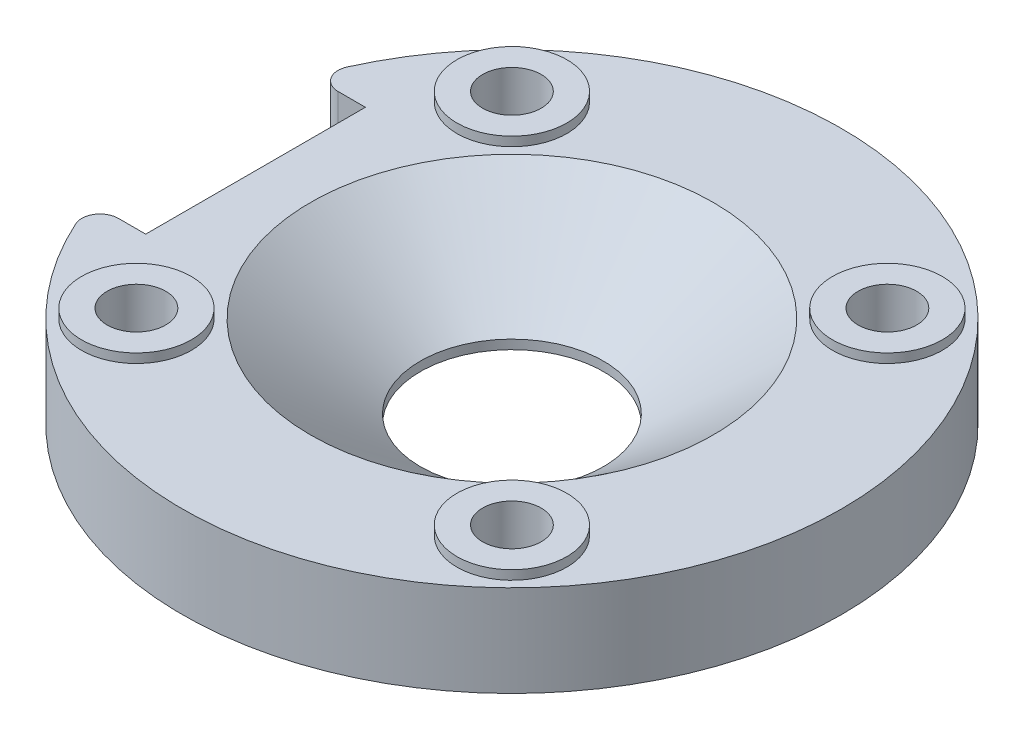
ISO-10303-21;
HEADER;
FILE_DESCRIPTION(('STEP AP214'),'2;1');
FILE_NAME('part.step','',(''),(''),'','','');
FILE_SCHEMA(('AUTOMOTIVE_DESIGN { 1 0 10303 214 1 1 1 1 }'));
ENDSEC;
DATA;
#1=APPLICATION_CONTEXT('core data for automotive mechanical design processes');
#2=APPLICATION_PROTOCOL_DEFINITION('international standard','automotive_design',2000,#1);
#3=PRODUCT_CONTEXT('',#1,'mechanical');
#4=PRODUCT('Part','Part','',(#3));
#5=PRODUCT_RELATED_PRODUCT_CATEGORY('part','',(#4));
#6=PRODUCT_DEFINITION_FORMATION('','',#4);
#7=PRODUCT_DEFINITION_CONTEXT('part definition',#1,'design');
#8=PRODUCT_DEFINITION('design','',#6,#7);
#9=PRODUCT_DEFINITION_SHAPE('','',#8);
#10=(LENGTH_UNIT() NAMED_UNIT(*) SI_UNIT(.MILLI.,.METRE.));
#11=(NAMED_UNIT(*) PLANE_ANGLE_UNIT() SI_UNIT($,.RADIAN.));
#12=(NAMED_UNIT(*) SI_UNIT($,.STERADIAN.) SOLID_ANGLE_UNIT());
#13=UNCERTAINTY_MEASURE_WITH_UNIT(LENGTH_MEASURE(1.E-05),#10,'distance_accuracy_value','');
#14=(GEOMETRIC_REPRESENTATION_CONTEXT(3) GLOBAL_UNCERTAINTY_ASSIGNED_CONTEXT((#13)) GLOBAL_UNIT_ASSIGNED_CONTEXT((#10,
#11,#12)) REPRESENTATION_CONTEXT('',''));
#15=CARTESIAN_POINT('',(0.,0.,0.));
#16=DIRECTION('',(0.,0.,1.));
#17=DIRECTION('',(1.,0.,0.));
#18=AXIS2_PLACEMENT_3D('',#15,#16,#17);
#19=CARTESIAN_POINT('',(0.,5.,0.));
#20=DIRECTION('',(0.,1.,0.));
#21=DIRECTION('',(0.,0.,1.));
#22=AXIS2_PLACEMENT_3D('',#19,#20,#21);
#23=PLANE('',#22);
#24=CARTESIAN_POINT('',(10.2530483272049,5.,10.253048327205));
#25=DIRECTION('',(0.,1.,0.));
#26=DIRECTION('',(0.,0.,1.));
#27=AXIS2_PLACEMENT_3D('',#24,#25,#26);
#28=CIRCLE('',#27,3.);
#29=CARTESIAN_POINT('',(10.2530483272049,5.,13.253048327205));
#30=VERTEX_POINT('',#29);
#31=EDGE_CURVE('E135',#30,#30,#28,.T.);
#32=ORIENTED_EDGE('',*,*,#31,.F.);
#33=EDGE_LOOP('',(#32));
#34=FACE_BOUND('',#33,.T.);
#35=CARTESIAN_POINT('',(-10.2530483272049,5.,-10.253048327205));
#36=DIRECTION('',(0.,1.,0.));
#37=DIRECTION('',(0.,0.,1.));
#38=AXIS2_PLACEMENT_3D('',#35,#36,#37);
#39=CIRCLE('',#38,3.);
#40=CARTESIAN_POINT('',(-10.2530483272049,5.,-7.25304832720495));
#41=VERTEX_POINT('',#40);
#42=EDGE_CURVE('E153',#41,#41,#39,.T.);
#43=ORIENTED_EDGE('',*,*,#42,.F.);
#44=EDGE_LOOP('',(#43));
#45=FACE_BOUND('',#44,.T.);
#46=CARTESIAN_POINT('',(0.,5.,0.));
#47=DIRECTION('',(0.,1.,0.));
#48=DIRECTION('',(0.,0.,1.));
#49=AXIS2_PLACEMENT_3D('',#46,#47,#48);
#50=CIRCLE('',#49,11.);
#51=CARTESIAN_POINT('',(0.,5.,11.));
#52=VERTEX_POINT('',#51);
#53=EDGE_CURVE('E172',#52,#52,#50,.F.);
#54=ORIENTED_EDGE('',*,*,#53,.T.);
#55=EDGE_LOOP('',(#54));
#56=FACE_BOUND('',#55,.T.);
#57=CARTESIAN_POINT('',(10.2530483272049,5.,-10.253048327205));
#58=DIRECTION('',(0.,1.,0.));
#59=DIRECTION('',(0.,0.,-1.));
#60=AXIS2_PLACEMENT_3D('',#57,#58,#59);
#61=CIRCLE('',#60,3.);
#62=CARTESIAN_POINT('',(10.2530483272049,5.,-13.253048327205));
#63=VERTEX_POINT('',#62);
#64=EDGE_CURVE('E144',#63,#63,#61,.T.);
#65=ORIENTED_EDGE('',*,*,#64,.F.);
#66=EDGE_LOOP('',(#65));
#67=FACE_BOUND('',#66,.T.);
#68=CARTESIAN_POINT('',(-10.2530483272049,5.,10.253048327205));
#69=DIRECTION('',(0.,1.,0.));
#70=DIRECTION('',(0.,0.,-1.));
#71=AXIS2_PLACEMENT_3D('',#68,#69,#70);
#72=CIRCLE('',#71,3.);
#73=CARTESIAN_POINT('',(-10.2530483272049,5.,7.25304832720497));
#74=VERTEX_POINT('',#73);
#75=EDGE_CURVE('E122',#74,#74,#72,.T.);
#76=ORIENTED_EDGE('',*,*,#75,.F.);
#77=EDGE_LOOP('',(#76));
#78=FACE_BOUND('',#77,.T.);
#79=DIRECTION('',(-1.,0.,0.));
#80=VECTOR('',#79,1.);
#81=CARTESIAN_POINT('',(0.,5.,6.));
#82=LINE('',#81,#80);
#83=CARTESIAN_POINT('',(-14.,5.,6.));
#84=VERTEX_POINT('',#83);
#85=CARTESIAN_POINT('',(-15.4919333848297,5.,6.));
#86=VERTEX_POINT('',#85);
#87=EDGE_CURVE('E94',#84,#86,#82,.T.);
#88=ORIENTED_EDGE('',*,*,#87,.T.);
#89=CARTESIAN_POINT('',(-15.4919333848297,5.,7.));
#90=DIRECTION('',(0.,1.,0.));
#91=DIRECTION('',(0.,0.,1.));
#92=AXIS2_PLACEMENT_3D('',#89,#90,#91);
#93=CIRCLE('',#92,1.);
#94=CARTESIAN_POINT('',(-16.4032235839373,5.,7.41176470588235));
#95=VERTEX_POINT('',#94);
#96=EDGE_CURVE('E189',#86,#95,#93,.T.);
#97=ORIENTED_EDGE('',*,*,#96,.T.);
#98=CARTESIAN_POINT('',(0.,5.,0.));
#99=DIRECTION('',(0.,1.,0.));
#100=DIRECTION('',(0.,0.,1.));
#101=AXIS2_PLACEMENT_3D('',#98,#99,#100);
#102=CIRCLE('',#101,18.);
#103=CARTESIAN_POINT('',(-16.4032235839373,5.,-7.41176470588235));
#104=VERTEX_POINT('',#103);
#105=EDGE_CURVE('E165',#95,#104,#102,.T.);
#106=ORIENTED_EDGE('',*,*,#105,.T.);
#107=CARTESIAN_POINT('',(-15.4919333848297,5.,-7.));
#108=DIRECTION('',(0.,1.,0.));
#109=DIRECTION('',(0.,0.,1.));
#110=AXIS2_PLACEMENT_3D('',#107,#108,#109);
#111=CIRCLE('',#110,1.);
#112=CARTESIAN_POINT('',(-15.4919333848297,5.,-6.));
#113=VERTEX_POINT('',#112);
#114=EDGE_CURVE('E187',#104,#113,#111,.T.);
#115=ORIENTED_EDGE('',*,*,#114,.T.);
#116=DIRECTION('',(1.,0.,0.));
#117=VECTOR('',#116,1.);
#118=CARTESIAN_POINT('',(0.,5.,-6.));
#119=LINE('',#118,#117);
#120=CARTESIAN_POINT('',(-14.,5.,-6.));
#121=VERTEX_POINT('',#120);
#122=EDGE_CURVE('E118',#113,#121,#119,.T.);
#123=ORIENTED_EDGE('',*,*,#122,.T.);
#124=DIRECTION('',(0.,0.,1.));
#125=VECTOR('',#124,1.);
#126=CARTESIAN_POINT('',(-14.,5.,0.));
#127=LINE('',#126,#125);
#128=EDGE_CURVE('E111',#121,#84,#127,.T.);
#129=ORIENTED_EDGE('',*,*,#128,.T.);
#130=EDGE_LOOP('',(#88,#97,#106,#115,#123,#129));
#131=FACE_BOUND('',#130,.T.);
#132=ADVANCED_FACE('F40',(#34,#45,#56,#67,#78,#131),#23,.T.);
#133=CARTESIAN_POINT('',(0.,0.,0.));
#134=DIRECTION('',(0.,1.,0.));
#135=DIRECTION('',(0.,0.,1.));
#136=AXIS2_PLACEMENT_3D('',#133,#134,#135);
#137=PLANE('',#136);
#138=CARTESIAN_POINT('',(0.,0.,0.));
#139=DIRECTION('',(0.,1.,0.));
#140=DIRECTION('',(0.,0.,1.));
#141=AXIS2_PLACEMENT_3D('',#138,#139,#140);
#142=CIRCLE('',#141,5.);
#143=CARTESIAN_POINT('',(0.,0.,5.));
#144=VERTEX_POINT('',#143);
#145=EDGE_CURVE('E160',#144,#144,#142,.T.);
#146=ORIENTED_EDGE('',*,*,#145,.T.);
#147=EDGE_LOOP('',(#146));
#148=FACE_BOUND('',#147,.T.);
#149=CARTESIAN_POINT('',(-10.2530483272049,0.,-10.253048327205));
#150=DIRECTION('',(0.,1.,0.));
#151=DIRECTION('',(0.,0.,1.));
#152=AXIS2_PLACEMENT_3D('',#149,#150,#151);
#153=CIRCLE('',#152,1.6);
#154=CARTESIAN_POINT('',(-10.2530483272049,0.,-8.65304832720495));
#155=VERTEX_POINT('',#154);
#156=EDGE_CURVE('E157',#155,#155,#153,.F.);
#157=ORIENTED_EDGE('',*,*,#156,.F.);
#158=EDGE_LOOP('',(#157));
#159=FACE_BOUND('',#158,.T.);
#160=CARTESIAN_POINT('',(-10.2530483272049,0.,10.253048327205));
#161=DIRECTION('',(0.,1.,0.));
#162=DIRECTION('',(0.,0.,1.));
#163=AXIS2_PLACEMENT_3D('',#160,#161,#162);
#164=CIRCLE('',#163,1.6);
#165=CARTESIAN_POINT('',(-10.2530483272049,0.,11.853048327205));
#166=VERTEX_POINT('',#165);
#167=EDGE_CURVE('E177',#166,#166,#164,.F.);
#168=ORIENTED_EDGE('',*,*,#167,.F.);
#169=EDGE_LOOP('',(#168));
#170=FACE_BOUND('',#169,.T.);
#171=CARTESIAN_POINT('',(10.2530483272049,0.,10.253048327205));
#172=DIRECTION('',(0.,1.,0.));
#173=DIRECTION('',(0.,0.,1.));
#174=AXIS2_PLACEMENT_3D('',#171,#172,#173);
#175=CIRCLE('',#174,1.6);
#176=CARTESIAN_POINT('',(10.2530483272049,0.,11.853048327205));
#177=VERTEX_POINT('',#176);
#178=EDGE_CURVE('E180',#177,#177,#175,.F.);
#179=ORIENTED_EDGE('',*,*,#178,.F.);
#180=EDGE_LOOP('',(#179));
#181=FACE_BOUND('',#180,.T.);
#182=CARTESIAN_POINT('',(10.2530483272049,0.,-10.253048327205));
#183=DIRECTION('',(0.,1.,0.));
#184=DIRECTION('',(0.,0.,1.));
#185=AXIS2_PLACEMENT_3D('',#182,#183,#184);
#186=CIRCLE('',#185,1.6);
#187=CARTESIAN_POINT('',(10.2530483272049,0.,-8.65304832720495));
#188=VERTEX_POINT('',#187);
#189=EDGE_CURVE('E164',#188,#188,#186,.F.);
#190=ORIENTED_EDGE('',*,*,#189,.F.);
#191=EDGE_LOOP('',(#190));
#192=FACE_BOUND('',#191,.T.);
#193=CARTESIAN_POINT('',(0.,0.,0.));
#194=DIRECTION('',(0.,1.,0.));
#195=DIRECTION('',(0.,0.,1.));
#196=AXIS2_PLACEMENT_3D('',#193,#194,#195);
#197=CIRCLE('',#196,18.);
#198=CARTESIAN_POINT('',(-16.4032235839373,0.,7.41176470588235));
#199=VERTEX_POINT('',#198);
#200=CARTESIAN_POINT('',(-16.4032235839373,0.,-7.41176470588235));
#201=VERTEX_POINT('',#200);
#202=EDGE_CURVE('E163',#199,#201,#197,.T.);
#203=ORIENTED_EDGE('',*,*,#202,.F.);
#204=CARTESIAN_POINT('',(-15.4919333848297,0.,7.));
#205=DIRECTION('',(0.,1.,0.));
#206=DIRECTION('',(0.,0.,1.));
#207=AXIS2_PLACEMENT_3D('',#204,#205,#206);
#208=CIRCLE('',#207,1.);
#209=CARTESIAN_POINT('',(-15.4919333848297,0.,6.));
#210=VERTEX_POINT('',#209);
#211=EDGE_CURVE('E48',#199,#210,#208,.F.);
#212=ORIENTED_EDGE('',*,*,#211,.T.);
#213=DIRECTION('',(-1.,0.,0.));
#214=VECTOR('',#213,1.);
#215=CARTESIAN_POINT('',(0.,0.,6.));
#216=LINE('',#215,#214);
#217=CARTESIAN_POINT('',(-14.,0.,6.));
#218=VERTEX_POINT('',#217);
#219=EDGE_CURVE('E105',#218,#210,#216,.T.);
#220=ORIENTED_EDGE('',*,*,#219,.F.);
#221=DIRECTION('',(0.,0.,1.));
#222=VECTOR('',#221,1.);
#223=CARTESIAN_POINT('',(-14.,0.,0.));
#224=LINE('',#223,#222);
#225=CARTESIAN_POINT('',(-14.,0.,-6.));
#226=VERTEX_POINT('',#225);
#227=EDGE_CURVE('E114',#226,#218,#224,.T.);
#228=ORIENTED_EDGE('',*,*,#227,.F.);
#229=DIRECTION('',(1.,0.,0.));
#230=VECTOR('',#229,1.);
#231=CARTESIAN_POINT('',(0.,0.,-6.));
#232=LINE('',#231,#230);
#233=CARTESIAN_POINT('',(-15.4919333848297,0.,-6.));
#234=VERTEX_POINT('',#233);
#235=EDGE_CURVE('E104',#234,#226,#232,.T.);
#236=ORIENTED_EDGE('',*,*,#235,.F.);
#237=CARTESIAN_POINT('',(-15.4919333848297,0.,-7.));
#238=DIRECTION('',(0.,1.,0.));
#239=DIRECTION('',(0.,0.,1.));
#240=AXIS2_PLACEMENT_3D('',#237,#238,#239);
#241=CIRCLE('',#240,1.);
#242=EDGE_CURVE('E55',#234,#201,#241,.F.);
#243=ORIENTED_EDGE('',*,*,#242,.T.);
#244=EDGE_LOOP('',(#203,#212,#220,#228,#236,#243));
#245=FACE_BOUND('',#244,.T.);
#246=ADVANCED_FACE('F196',(#148,#159,#170,#181,#192,#245),#137,.F.);
#247=CARTESIAN_POINT('',(0.,5.,0.));
#248=DIRECTION('',(0.,-1.,0.));
#249=DIRECTION('',(0.,0.,-1.));
#250=AXIS2_PLACEMENT_3D('',#247,#248,#249);
#251=CYLINDRICAL_SURFACE('',#250,18.);
#252=ORIENTED_EDGE('',*,*,#105,.F.);
#253=DIRECTION('',(0.,-1.,0.));
#254=VECTOR('',#253,1.);
#255=CARTESIAN_POINT('',(-16.4032235839373,5.,7.41176470588235));
#256=LINE('',#255,#254);
#257=EDGE_CURVE('E193',#95,#199,#256,.T.);
#258=ORIENTED_EDGE('',*,*,#257,.T.);
#259=ORIENTED_EDGE('',*,*,#202,.T.);
#260=DIRECTION('',(0.,-1.,0.));
#261=VECTOR('',#260,1.);
#262=CARTESIAN_POINT('',(-16.4032235839373,5.,-7.41176470588236));
#263=LINE('',#262,#261);
#264=EDGE_CURVE('E191',#201,#104,#263,.F.);
#265=ORIENTED_EDGE('',*,*,#264,.T.);
#266=EDGE_LOOP('',(#252,#258,#259,#265));
#267=FACE_BOUND('',#266,.T.);
#268=ADVANCED_FACE('F204',(#267),#251,.T.);
#269=CARTESIAN_POINT('',(0.,5.,0.));
#270=DIRECTION('',(0.,-1.,0.));
#271=DIRECTION('',(0.,0.,-1.));
#272=AXIS2_PLACEMENT_3D('',#269,#270,#271);
#273=CYLINDRICAL_SURFACE('',#272,5.);
#274=CARTESIAN_POINT('',(0.,0.499999999999996,0.));
#275=DIRECTION('',(0.,1.,0.));
#276=DIRECTION('',(0.,0.,1.));
#277=AXIS2_PLACEMENT_3D('',#274,#275,#276);
#278=CIRCLE('',#277,5.);
#279=CARTESIAN_POINT('',(0.,0.499999999999996,5.));
#280=VERTEX_POINT('',#279);
#281=EDGE_CURVE('E168',#280,#280,#278,.T.);
#282=ORIENTED_EDGE('',*,*,#281,.T.);
#283=EDGE_LOOP('',(#282));
#284=FACE_BOUND('',#283,.T.);
#285=ORIENTED_EDGE('',*,*,#145,.F.);
#286=EDGE_LOOP('',(#285));
#287=FACE_BOUND('',#286,.T.);
#288=ADVANCED_FACE('F228',(#284,#287),#273,.F.);
#289=CARTESIAN_POINT('',(0.,0.499999999999996,0.));
#290=DIRECTION('',(0.,1.,0.));
#291=DIRECTION('',(0.,0.,1.));
#292=AXIS2_PLACEMENT_3D('',#289,#290,#291);
#293=CONICAL_SURFACE('',#292,5.,0.927295218001613);
#294=ORIENTED_EDGE('',*,*,#53,.F.);
#295=EDGE_LOOP('',(#294));
#296=FACE_BOUND('',#295,.T.);
#297=ORIENTED_EDGE('',*,*,#281,.F.);
#298=EDGE_LOOP('',(#297));
#299=FACE_BOUND('',#298,.T.);
#300=ADVANCED_FACE('F234',(#296,#299),#293,.F.);
#301=CARTESIAN_POINT('',(-10.2530483272049,15.,-10.253048327205));
#302=DIRECTION('',(0.,-1.,0.));
#303=DIRECTION('',(0.,0.,-1.));
#304=AXIS2_PLACEMENT_3D('',#301,#302,#303);
#305=CYLINDRICAL_SURFACE('',#304,1.6);
#306=ORIENTED_EDGE('',*,*,#156,.T.);
#307=EDGE_LOOP('',(#306));
#308=FACE_BOUND('',#307,.T.);
#309=CARTESIAN_POINT('',(-10.2530483272049,5.5,-10.253048327205));
#310=DIRECTION('',(0.,1.,0.));
#311=DIRECTION('',(0.,0.,1.));
#312=AXIS2_PLACEMENT_3D('',#309,#310,#311);
#313=CIRCLE('',#312,1.6);
#314=CARTESIAN_POINT('',(-10.2530483272049,5.5,-8.65304832720495));
#315=VERTEX_POINT('',#314);
#316=EDGE_CURVE('E148',#315,#315,#313,.T.);
#317=ORIENTED_EDGE('',*,*,#316,.T.);
#318=EDGE_LOOP('',(#317));
#319=FACE_BOUND('',#318,.T.);
#320=ADVANCED_FACE('F238',(#308,#319),#305,.F.);
#321=CARTESIAN_POINT('',(-10.2530483272049,15.,10.253048327205));
#322=DIRECTION('',(0.,-1.,0.));
#323=DIRECTION('',(0.,0.,-1.));
#324=AXIS2_PLACEMENT_3D('',#321,#322,#323);
#325=CYLINDRICAL_SURFACE('',#324,1.6);
#326=ORIENTED_EDGE('',*,*,#167,.T.);
#327=EDGE_LOOP('',(#326));
#328=FACE_BOUND('',#327,.T.);
#329=CARTESIAN_POINT('',(-10.2530483272049,5.5,10.253048327205));
#330=DIRECTION('',(0.,1.,0.));
#331=DIRECTION('',(0.,0.,1.));
#332=AXIS2_PLACEMENT_3D('',#329,#330,#331);
#333=CIRCLE('',#332,1.6);
#334=CARTESIAN_POINT('',(-10.2530483272049,5.5,11.853048327205));
#335=VERTEX_POINT('',#334);
#336=EDGE_CURVE('E119',#335,#335,#333,.T.);
#337=ORIENTED_EDGE('',*,*,#336,.T.);
#338=EDGE_LOOP('',(#337));
#339=FACE_BOUND('',#338,.T.);
#340=ADVANCED_FACE('F367',(#328,#339),#325,.F.);
#341=CARTESIAN_POINT('',(10.2530483272049,15.,10.253048327205));
#342=DIRECTION('',(0.,-1.,0.));
#343=DIRECTION('',(0.,0.,-1.));
#344=AXIS2_PLACEMENT_3D('',#341,#342,#343);
#345=CYLINDRICAL_SURFACE('',#344,1.6);
#346=ORIENTED_EDGE('',*,*,#178,.T.);
#347=EDGE_LOOP('',(#346));
#348=FACE_BOUND('',#347,.T.);
#349=CARTESIAN_POINT('',(10.2530483272049,5.5,10.253048327205));
#350=DIRECTION('',(0.,1.,0.));
#351=DIRECTION('',(0.,0.,1.));
#352=AXIS2_PLACEMENT_3D('',#349,#350,#351);
#353=CIRCLE('',#352,1.6);
#354=CARTESIAN_POINT('',(10.2530483272049,5.5,11.853048327205));
#355=VERTEX_POINT('',#354);
#356=EDGE_CURVE('E130',#355,#355,#353,.T.);
#357=ORIENTED_EDGE('',*,*,#356,.T.);
#358=EDGE_LOOP('',(#357));
#359=FACE_BOUND('',#358,.T.);
#360=ADVANCED_FACE('F357',(#348,#359),#345,.F.);
#361=CARTESIAN_POINT('',(10.2530483272049,15.,-10.253048327205));
#362=DIRECTION('',(0.,-1.,0.));
#363=DIRECTION('',(0.,0.,-1.));
#364=AXIS2_PLACEMENT_3D('',#361,#362,#363);
#365=CYLINDRICAL_SURFACE('',#364,1.6);
#366=ORIENTED_EDGE('',*,*,#189,.T.);
#367=EDGE_LOOP('',(#366));
#368=FACE_BOUND('',#367,.T.);
#369=CARTESIAN_POINT('',(10.2530483272049,5.5,-10.253048327205));
#370=DIRECTION('',(0.,1.,0.));
#371=DIRECTION('',(0.,0.,1.));
#372=AXIS2_PLACEMENT_3D('',#369,#370,#371);
#373=CIRCLE('',#372,1.6);
#374=CARTESIAN_POINT('',(10.2530483272049,5.5,-8.65304832720495));
#375=VERTEX_POINT('',#374);
#376=EDGE_CURVE('E139',#375,#375,#373,.T.);
#377=ORIENTED_EDGE('',*,*,#376,.T.);
#378=EDGE_LOOP('',(#377));
#379=FACE_BOUND('',#378,.T.);
#380=ADVANCED_FACE('F347',(#368,#379),#365,.F.);
#381=CARTESIAN_POINT('',(-10.2530483272049,5.5,-10.253048327205));
#382=DIRECTION('',(0.,1.,0.));
#383=DIRECTION('',(0.,0.,1.));
#384=AXIS2_PLACEMENT_3D('',#381,#382,#383);
#385=PLANE('',#384);
#386=CARTESIAN_POINT('',(-10.2530483272049,5.5,-10.253048327205));
#387=DIRECTION('',(0.,1.,0.));
#388=DIRECTION('',(0.,0.,1.));
#389=AXIS2_PLACEMENT_3D('',#386,#387,#388);
#390=CIRCLE('',#389,3.);
#391=CARTESIAN_POINT('',(-10.2530483272049,5.5,-7.25304832720495));
#392=VERTEX_POINT('',#391);
#393=EDGE_CURVE('E154',#392,#392,#390,.T.);
#394=ORIENTED_EDGE('',*,*,#393,.T.);
#395=EDGE_LOOP('',(#394));
#396=FACE_BOUND('',#395,.T.);
#397=ORIENTED_EDGE('',*,*,#316,.F.);
#398=EDGE_LOOP('',(#397));
#399=FACE_BOUND('',#398,.T.);
#400=ADVANCED_FACE('F337',(#396,#399),#385,.T.);
#401=CARTESIAN_POINT('',(-10.2530483272049,5.5,-10.253048327205));
#402=DIRECTION('',(0.,-1.,0.));
#403=DIRECTION('',(0.,0.,-1.));
#404=AXIS2_PLACEMENT_3D('',#401,#402,#403);
#405=CYLINDRICAL_SURFACE('',#404,3.);
#406=ORIENTED_EDGE('',*,*,#393,.F.);
#407=EDGE_LOOP('',(#406));
#408=FACE_BOUND('',#407,.T.);
#409=ORIENTED_EDGE('',*,*,#42,.T.);
#410=EDGE_LOOP('',(#409));
#411=FACE_BOUND('',#410,.T.);
#412=ADVANCED_FACE('F327',(#408,#411),#405,.T.);
#413=CARTESIAN_POINT('',(10.2530483272049,5.5,-10.253048327205));
#414=DIRECTION('',(0.,-1.,0.));
#415=DIRECTION('',(0.,0.,-1.));
#416=AXIS2_PLACEMENT_3D('',#413,#414,#415);
#417=PLANE('',#416);
#418=CARTESIAN_POINT('',(10.2530483272049,5.5,-10.253048327205));
#419=DIRECTION('',(0.,1.,0.));
#420=DIRECTION('',(0.,0.,-1.));
#421=AXIS2_PLACEMENT_3D('',#418,#419,#420);
#422=CIRCLE('',#421,3.);
#423=CARTESIAN_POINT('',(10.2530483272049,5.5,-13.253048327205));
#424=VERTEX_POINT('',#423);
#425=EDGE_CURVE('E145',#424,#424,#422,.T.);
#426=ORIENTED_EDGE('',*,*,#425,.T.);
#427=EDGE_LOOP('',(#426));
#428=FACE_BOUND('',#427,.T.);
#429=ORIENTED_EDGE('',*,*,#376,.F.);
#430=EDGE_LOOP('',(#429));
#431=FACE_BOUND('',#430,.T.);
#432=ADVANCED_FACE('F317',(#428,#431),#417,.F.);
#433=CARTESIAN_POINT('',(10.2530483272049,5.5,-10.253048327205));
#434=DIRECTION('',(0.,-1.,0.));
#435=DIRECTION('',(0.,0.,-1.));
#436=AXIS2_PLACEMENT_3D('',#433,#434,#435);
#437=CYLINDRICAL_SURFACE('',#436,3.);
#438=ORIENTED_EDGE('',*,*,#425,.F.);
#439=EDGE_LOOP('',(#438));
#440=FACE_BOUND('',#439,.T.);
#441=ORIENTED_EDGE('',*,*,#64,.T.);
#442=EDGE_LOOP('',(#441));
#443=FACE_BOUND('',#442,.T.);
#444=ADVANCED_FACE('F307',(#440,#443),#437,.T.);
#445=CARTESIAN_POINT('',(10.2530483272049,5.5,10.253048327205));
#446=DIRECTION('',(0.,1.,0.));
#447=DIRECTION('',(0.,0.,1.));
#448=AXIS2_PLACEMENT_3D('',#445,#446,#447);
#449=PLANE('',#448);
#450=CARTESIAN_POINT('',(10.2530483272049,5.5,10.253048327205));
#451=DIRECTION('',(0.,1.,0.));
#452=DIRECTION('',(0.,0.,1.));
#453=AXIS2_PLACEMENT_3D('',#450,#451,#452);
#454=CIRCLE('',#453,3.);
#455=CARTESIAN_POINT('',(10.2530483272049,5.5,13.253048327205));
#456=VERTEX_POINT('',#455);
#457=EDGE_CURVE('E136',#456,#456,#454,.T.);
#458=ORIENTED_EDGE('',*,*,#457,.T.);
#459=EDGE_LOOP('',(#458));
#460=FACE_BOUND('',#459,.T.);
#461=ORIENTED_EDGE('',*,*,#356,.F.);
#462=EDGE_LOOP('',(#461));
#463=FACE_BOUND('',#462,.T.);
#464=ADVANCED_FACE('F297',(#460,#463),#449,.T.);
#465=CARTESIAN_POINT('',(10.2530483272049,5.5,10.253048327205));
#466=DIRECTION('',(0.,-1.,0.));
#467=DIRECTION('',(0.,0.,-1.));
#468=AXIS2_PLACEMENT_3D('',#465,#466,#467);
#469=CYLINDRICAL_SURFACE('',#468,3.);
#470=ORIENTED_EDGE('',*,*,#457,.F.);
#471=EDGE_LOOP('',(#470));
#472=FACE_BOUND('',#471,.T.);
#473=ORIENTED_EDGE('',*,*,#31,.T.);
#474=EDGE_LOOP('',(#473));
#475=FACE_BOUND('',#474,.T.);
#476=ADVANCED_FACE('F287',(#472,#475),#469,.T.);
#477=CARTESIAN_POINT('',(-10.2530483272049,5.5,10.253048327205));
#478=DIRECTION('',(0.,-1.,0.));
#479=DIRECTION('',(0.,0.,-1.));
#480=AXIS2_PLACEMENT_3D('',#477,#478,#479);
#481=PLANE('',#480);
#482=CARTESIAN_POINT('',(-10.2530483272049,5.5,10.253048327205));
#483=DIRECTION('',(0.,1.,0.));
#484=DIRECTION('',(0.,0.,-1.));
#485=AXIS2_PLACEMENT_3D('',#482,#483,#484);
#486=CIRCLE('',#485,3.);
#487=CARTESIAN_POINT('',(-10.2530483272049,5.5,7.25304832720497));
#488=VERTEX_POINT('',#487);
#489=EDGE_CURVE('E127',#488,#488,#486,.T.);
#490=ORIENTED_EDGE('',*,*,#489,.T.);
#491=EDGE_LOOP('',(#490));
#492=FACE_BOUND('',#491,.T.);
#493=ORIENTED_EDGE('',*,*,#336,.F.);
#494=EDGE_LOOP('',(#493));
#495=FACE_BOUND('',#494,.T.);
#496=ADVANCED_FACE('F277',(#492,#495),#481,.F.);
#497=CARTESIAN_POINT('',(-10.2530483272049,5.5,10.253048327205));
#498=DIRECTION('',(0.,-1.,0.));
#499=DIRECTION('',(0.,0.,-1.));
#500=AXIS2_PLACEMENT_3D('',#497,#498,#499);
#501=CYLINDRICAL_SURFACE('',#500,3.);
#502=ORIENTED_EDGE('',*,*,#489,.F.);
#503=EDGE_LOOP('',(#502));
#504=FACE_BOUND('',#503,.T.);
#505=ORIENTED_EDGE('',*,*,#75,.T.);
#506=EDGE_LOOP('',(#505));
#507=FACE_BOUND('',#506,.T.);
#508=ADVANCED_FACE('F215',(#504,#507),#501,.T.);
#509=CARTESIAN_POINT('',(-14.,15.,6.));
#510=DIRECTION('',(-1.,0.,0.));
#511=DIRECTION('',(0.,0.,1.));
#512=AXIS2_PLACEMENT_3D('',#509,#510,#511);
#513=PLANE('',#512);
#514=DIRECTION('',(0.,-1.,0.));
#515=VECTOR('',#514,1.);
#516=CARTESIAN_POINT('',(-14.,15.,-6.));
#517=LINE('',#516,#515);
#518=EDGE_CURVE('E115',#121,#226,#517,.T.);
#519=ORIENTED_EDGE('',*,*,#518,.T.);
#520=ORIENTED_EDGE('',*,*,#227,.T.);
#521=DIRECTION('',(0.,-1.,0.));
#522=VECTOR('',#521,1.);
#523=CARTESIAN_POINT('',(-14.,15.,6.));
#524=LINE('',#523,#522);
#525=EDGE_CURVE('E98',#84,#218,#524,.T.);
#526=ORIENTED_EDGE('',*,*,#525,.F.);
#527=ORIENTED_EDGE('',*,*,#128,.F.);
#528=EDGE_LOOP('',(#519,#520,#526,#527));
#529=FACE_BOUND('',#528,.T.);
#530=ADVANCED_FACE('F110',(#529),#513,.T.);
#531=CARTESIAN_POINT('',(-22.,15.,-6.));
#532=DIRECTION('',(0.,0.,1.));
#533=DIRECTION('',(1.,0.,0.));
#534=AXIS2_PLACEMENT_3D('',#531,#532,#533);
#535=PLANE('',#534);
#536=ORIENTED_EDGE('',*,*,#122,.F.);
#537=DIRECTION('',(0.,1.,0.));
#538=VECTOR('',#537,1.);
#539=CARTESIAN_POINT('',(-15.4919333848297,0.,-6.));
#540=LINE('',#539,#538);
#541=EDGE_CURVE('E11',#113,#234,#540,.F.);
#542=ORIENTED_EDGE('',*,*,#541,.T.);
#543=ORIENTED_EDGE('',*,*,#235,.T.);
#544=ORIENTED_EDGE('',*,*,#518,.F.);
#545=EDGE_LOOP('',(#536,#542,#543,#544));
#546=FACE_BOUND('',#545,.T.);
#547=ADVANCED_FACE('F206',(#546),#535,.T.);
#548=CARTESIAN_POINT('',(-22.,15.,6.));
#549=DIRECTION('',(0.,0.,-1.));
#550=DIRECTION('',(-1.,0.,0.));
#551=AXIS2_PLACEMENT_3D('',#548,#549,#550);
#552=PLANE('',#551);
#553=ORIENTED_EDGE('',*,*,#219,.T.);
#554=DIRECTION('',(0.,1.,0.));
#555=VECTOR('',#554,1.);
#556=CARTESIAN_POINT('',(-15.4919333848297,5.,6.));
#557=LINE('',#556,#555);
#558=EDGE_CURVE('E101',#210,#86,#557,.T.);
#559=ORIENTED_EDGE('',*,*,#558,.T.);
#560=ORIENTED_EDGE('',*,*,#87,.F.);
#561=ORIENTED_EDGE('',*,*,#525,.T.);
#562=EDGE_LOOP('',(#553,#559,#560,#561));
#563=FACE_BOUND('',#562,.T.);
#564=ADVANCED_FACE('F97',(#563),#552,.T.);
#565=CARTESIAN_POINT('',(-15.4919333848297,5.,7.));
#566=DIRECTION('',(0.,-1.,0.));
#567=DIRECTION('',(0.,0.,-1.));
#568=AXIS2_PLACEMENT_3D('',#565,#566,#567);
#569=CYLINDRICAL_SURFACE('',#568,1.);
#570=ORIENTED_EDGE('',*,*,#211,.F.);
#571=ORIENTED_EDGE('',*,*,#257,.F.);
#572=ORIENTED_EDGE('',*,*,#96,.F.);
#573=ORIENTED_EDGE('',*,*,#558,.F.);
#574=EDGE_LOOP('',(#570,#571,#572,#573));
#575=FACE_BOUND('',#574,.T.);
#576=ADVANCED_FACE('F200',(#575),#569,.T.);
#577=CARTESIAN_POINT('',(-15.4919333848297,5.,-7.));
#578=DIRECTION('',(0.,-1.,0.));
#579=DIRECTION('',(0.,0.,-1.));
#580=AXIS2_PLACEMENT_3D('',#577,#578,#579);
#581=CYLINDRICAL_SURFACE('',#580,1.);
#582=ORIENTED_EDGE('',*,*,#114,.F.);
#583=ORIENTED_EDGE('',*,*,#264,.F.);
#584=ORIENTED_EDGE('',*,*,#242,.F.);
#585=ORIENTED_EDGE('',*,*,#541,.F.);
#586=EDGE_LOOP('',(#582,#583,#584,#585));
#587=FACE_BOUND('',#586,.T.);
#588=ADVANCED_FACE('F42',(#587),#581,.T.);
#589=CLOSED_SHELL('',(#132,#246,#268,#288,#300,#320,#340,#360,#380,#400,#412,#432,#444,#464,
#476,#496,#508,#530,#547,#564,#576,#588));
#590=MANIFOLD_SOLID_BREP('B2',#589);
#591=ADVANCED_BREP_SHAPE_REPRESENTATION('',(#18,#590),#14);
#592=SHAPE_DEFINITION_REPRESENTATION(#9,#591);
ENDSEC;
END-ISO-10303-21;
